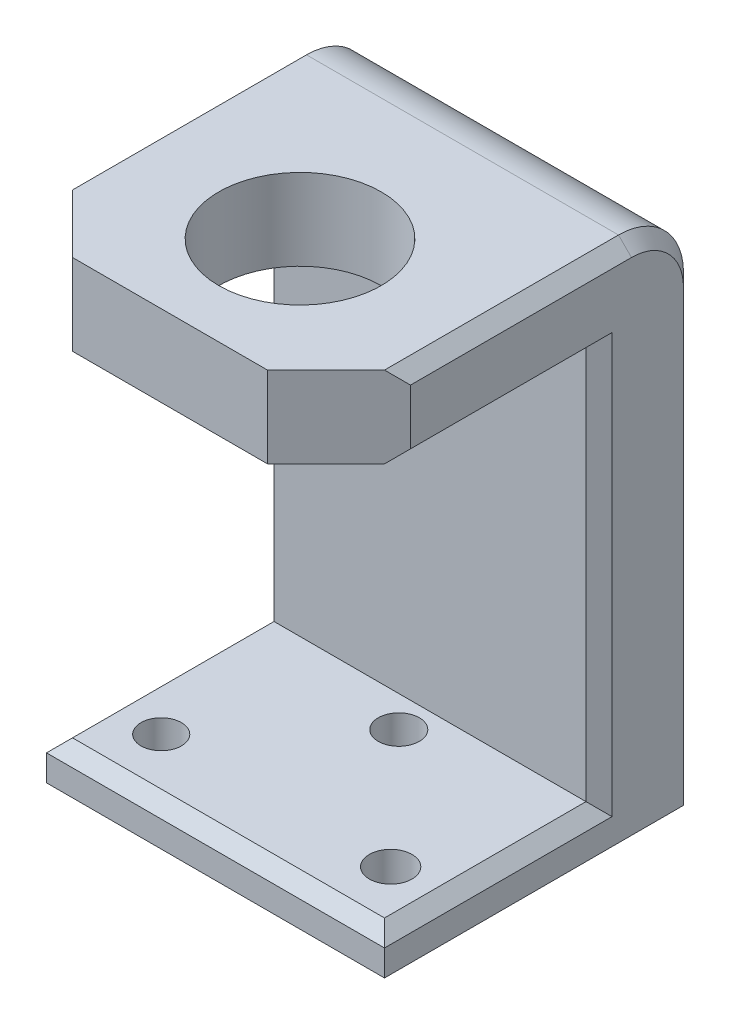
ISO-10303-21;
HEADER;
FILE_DESCRIPTION(('STEP AP214'),'2;1');
FILE_NAME('part.step','',(''),(''),'','','');
FILE_SCHEMA(('AUTOMOTIVE_DESIGN { 1 0 10303 214 1 1 1 1 }'));
ENDSEC;
DATA;
#1=APPLICATION_CONTEXT('core data for automotive mechanical design processes');
#2=APPLICATION_PROTOCOL_DEFINITION('international standard','automotive_design',2000,#1);
#3=PRODUCT_CONTEXT('',#1,'mechanical');
#4=PRODUCT('Part','Part','',(#3));
#5=PRODUCT_RELATED_PRODUCT_CATEGORY('part','',(#4));
#6=PRODUCT_DEFINITION_FORMATION('','',#4);
#7=PRODUCT_DEFINITION_CONTEXT('part definition',#1,'design');
#8=PRODUCT_DEFINITION('design','',#6,#7);
#9=PRODUCT_DEFINITION_SHAPE('','',#8);
#10=(LENGTH_UNIT() NAMED_UNIT(*) SI_UNIT(.MILLI.,.METRE.));
#11=(NAMED_UNIT(*) PLANE_ANGLE_UNIT() SI_UNIT($,.RADIAN.));
#12=(NAMED_UNIT(*) SI_UNIT($,.STERADIAN.) SOLID_ANGLE_UNIT());
#13=UNCERTAINTY_MEASURE_WITH_UNIT(LENGTH_MEASURE(1.E-05),#10,'distance_accuracy_value','');
#14=(GEOMETRIC_REPRESENTATION_CONTEXT(3) GLOBAL_UNCERTAINTY_ASSIGNED_CONTEXT((#13)) GLOBAL_UNIT_ASSIGNED_CONTEXT((#10,
#11,#12)) REPRESENTATION_CONTEXT('',''));
#15=CARTESIAN_POINT('',(0.,0.,0.));
#16=DIRECTION('',(0.,0.,1.));
#17=DIRECTION('',(1.,0.,0.));
#18=AXIS2_PLACEMENT_3D('',#15,#16,#17);
#19=CARTESIAN_POINT('',(-43.4955346226071,100.33,49.6007689250872));
#20=DIRECTION('',(0.,0.,-1.));
#21=DIRECTION('',(-1.,0.,0.));
#22=AXIS2_PLACEMENT_3D('',#19,#20,#21);
#23=PLANE('',#22);
#24=DIRECTION('',(1.,0.,0.));
#25=VECTOR('',#24,1.);
#26=CARTESIAN_POINT('',(-43.4955346226071,7.62,49.6007689250872));
#27=LINE('',#26,#25);
#28=CARTESIAN_POINT('',(-40.9555346226071,7.62,49.6007689250872));
#29=VERTEX_POINT('',#28);
#30=CARTESIAN_POINT('',(20.0044653773929,7.62,49.6007689250872));
#31=VERTEX_POINT('',#30);
#32=EDGE_CURVE('E396',#29,#31,#27,.T.);
#33=ORIENTED_EDGE('',*,*,#32,.T.);
#34=DIRECTION('',(0.,1.,0.));
#35=VECTOR('',#34,1.);
#36=CARTESIAN_POINT('',(20.0044653773929,100.33,49.6007689250872));
#37=LINE('',#36,#35);
#38=CARTESIAN_POINT('',(20.0044653773928,84.455,49.6007689250872));
#39=VERTEX_POINT('',#38);
#40=EDGE_CURVE('E293',#31,#39,#37,.T.);
#41=ORIENTED_EDGE('',*,*,#40,.T.);
#42=DIRECTION('',(1.,0.,0.));
#43=VECTOR('',#42,1.);
#44=CARTESIAN_POINT('',(-43.4955346226071,84.455,49.6007689250872));
#45=LINE('',#44,#43);
#46=CARTESIAN_POINT('',(-40.9555346226071,84.455,49.6007689250872));
#47=VERTEX_POINT('',#46);
#48=EDGE_CURVE('E421',#47,#39,#45,.T.);
#49=ORIENTED_EDGE('',*,*,#48,.F.);
#50=DIRECTION('',(0.,-1.,0.));
#51=VECTOR('',#50,1.);
#52=CARTESIAN_POINT('',(-40.9555346226071,100.33,49.6007689250872));
#53=LINE('',#52,#51);
#54=EDGE_CURVE('E290',#47,#29,#53,.T.);
#55=ORIENTED_EDGE('',*,*,#54,.T.);
#56=EDGE_LOOP('',(#33,#41,#49,#55));
#57=FACE_BOUND('',#56,.T.);
#58=ADVANCED_FACE('F39',(#57),#23,.F.);
#59=CARTESIAN_POINT('',(0.,7.62,0.));
#60=DIRECTION('',(0.,-1.,0.));
#61=DIRECTION('',(0.,0.,-1.));
#62=AXIS2_PLACEMENT_3D('',#59,#60,#61);
#63=PLANE('',#62);
#64=CARTESIAN_POINT('',(-10.4755346226071,7.62,55.6973401149321));
#65=DIRECTION('',(0.,1.,0.));
#66=DIRECTION('',(0.,0.,1.));
#67=AXIS2_PLACEMENT_3D('',#64,#65,#66);
#68=CIRCLE('',#67,4.00939943817813);
#69=CARTESIAN_POINT('',(-10.4755346226071,7.62,59.7067395531102));
#70=VERTEX_POINT('',#69);
#71=EDGE_CURVE('E431',#70,#70,#68,.T.);
#72=ORIENTED_EDGE('',*,*,#71,.F.);
#73=EDGE_LOOP('',(#72));
#74=FACE_BOUND('',#73,.T.);
#75=CARTESIAN_POINT('',(11.9399653773929,7.62,79.7003401149321));
#76=DIRECTION('',(0.,1.,0.));
#77=DIRECTION('',(0.,0.,1.));
#78=AXIS2_PLACEMENT_3D('',#75,#76,#77);
#79=CIRCLE('',#78,4.16988491083855);
#80=CARTESIAN_POINT('',(11.9399653773929,7.62,83.8702250257706));
#81=VERTEX_POINT('',#80);
#82=EDGE_CURVE('E439',#81,#81,#79,.T.);
#83=ORIENTED_EDGE('',*,*,#82,.F.);
#84=EDGE_LOOP('',(#83));
#85=FACE_BOUND('',#84,.T.);
#86=CARTESIAN_POINT('',(-32.8910346226071,7.62,79.7003401149321));
#87=DIRECTION('',(0.,1.,0.));
#88=DIRECTION('',(0.,0.,1.));
#89=AXIS2_PLACEMENT_3D('',#86,#87,#88);
#90=CIRCLE('',#89,3.94964349540739);
#91=CARTESIAN_POINT('',(-32.8910346226071,7.62,83.6499836103395));
#92=VERTEX_POINT('',#91);
#93=EDGE_CURVE('E200',#92,#92,#90,.T.);
#94=ORIENTED_EDGE('',*,*,#93,.F.);
#95=EDGE_LOOP('',(#94));
#96=FACE_BOUND('',#95,.T.);
#97=DIRECTION('',(1.,0.,0.));
#98=VECTOR('',#97,1.);
#99=CARTESIAN_POINT('',(0.,7.62,88.9707689250872));
#100=LINE('',#99,#98);
#101=CARTESIAN_POINT('',(-40.9555346226071,7.62,88.9707689250872));
#102=VERTEX_POINT('',#101);
#103=CARTESIAN_POINT('',(20.0044653773929,7.62,88.9707689250872));
#104=VERTEX_POINT('',#103);
#105=EDGE_CURVE('E299',#102,#104,#100,.T.);
#106=ORIENTED_EDGE('',*,*,#105,.T.);
#107=DIRECTION('',(0.,0.,-1.));
#108=VECTOR('',#107,1.);
#109=CARTESIAN_POINT('',(20.0044653773928,7.62,0.));
#110=LINE('',#109,#108);
#111=EDGE_CURVE('E302',#104,#31,#110,.T.);
#112=ORIENTED_EDGE('',*,*,#111,.T.);
#113=ORIENTED_EDGE('',*,*,#32,.F.);
#114=DIRECTION('',(0.,0.,1.));
#115=VECTOR('',#114,1.);
#116=CARTESIAN_POINT('',(-40.9555346226071,7.62,0.));
#117=LINE('',#116,#115);
#118=EDGE_CURVE('E296',#29,#102,#117,.T.);
#119=ORIENTED_EDGE('',*,*,#118,.T.);
#120=EDGE_LOOP('',(#106,#112,#113,#119));
#121=FACE_BOUND('',#120,.T.);
#122=ADVANCED_FACE('F423',(#74,#85,#96,#121),#63,.F.);
#123=CARTESIAN_POINT('',(0.,0.,0.));
#124=DIRECTION('',(0.,-1.,0.));
#125=DIRECTION('',(0.,0.,-1.));
#126=AXIS2_PLACEMENT_3D('',#123,#124,#125);
#127=PLANE('',#126);
#128=CARTESIAN_POINT('',(11.9399653773929,0.,79.7003401149321));
#129=DIRECTION('',(0.,1.,0.));
#130=DIRECTION('',(0.,0.,1.));
#131=AXIS2_PLACEMENT_3D('',#128,#129,#130);
#132=CIRCLE('',#131,4.16988491083855);
#133=CARTESIAN_POINT('',(11.9399653773929,0.,83.8702250257706));
#134=VERTEX_POINT('',#133);
#135=EDGE_CURVE('E437',#134,#134,#132,.T.);
#136=ORIENTED_EDGE('',*,*,#135,.T.);
#137=EDGE_LOOP('',(#136));
#138=FACE_BOUND('',#137,.T.);
#139=DIRECTION('',(0.,0.,1.));
#140=VECTOR('',#139,1.);
#141=CARTESIAN_POINT('',(-43.4955346226071,0.,30.5507689250872));
#142=LINE('',#141,#140);
#143=CARTESIAN_POINT('',(-43.4955346226071,0.,33.0907689250872));
#144=VERTEX_POINT('',#143);
#145=CARTESIAN_POINT('',(-43.4955346226071,0.,91.5107689250872));
#146=VERTEX_POINT('',#145);
#147=EDGE_CURVE('E211',#144,#146,#142,.T.);
#148=ORIENTED_EDGE('',*,*,#147,.F.);
#149=DIRECTION('',(-0.707106781186548,0.,0.707106781186548));
#150=VECTOR('',#149,1.);
#151=CARTESIAN_POINT('',(-5.20238284875994,0.,-5.20238284875994));
#152=LINE('',#151,#150);
#153=CARTESIAN_POINT('',(-40.9555346226071,0.,30.5507689250872));
#154=VERTEX_POINT('',#153);
#155=EDGE_CURVE('E257',#144,#154,#152,.F.);
#156=ORIENTED_EDGE('',*,*,#155,.T.);
#157=DIRECTION('',(-1.,0.,0.));
#158=VECTOR('',#157,1.);
#159=CARTESIAN_POINT('',(-43.4955346226071,0.,30.5507689250872));
#160=LINE('',#159,#158);
#161=CARTESIAN_POINT('',(20.0044653773929,0.,30.5507689250872));
#162=VERTEX_POINT('',#161);
#163=EDGE_CURVE('E194',#162,#154,#160,.T.);
#164=ORIENTED_EDGE('',*,*,#163,.F.);
#165=DIRECTION('',(-0.707106781186548,0.,-0.707106781186547));
#166=VECTOR('',#165,1.);
#167=CARTESIAN_POINT('',(-5.27315177384719,0.,5.2731517738472));
#168=LINE('',#167,#166);
#169=CARTESIAN_POINT('',(22.5444653773929,0.,33.0907689250872));
#170=VERTEX_POINT('',#169);
#171=EDGE_CURVE('E192',#162,#170,#168,.F.);
#172=ORIENTED_EDGE('',*,*,#171,.T.);
#173=DIRECTION('',(0.,0.,-1.));
#174=VECTOR('',#173,1.);
#175=CARTESIAN_POINT('',(22.5444653773929,0.,30.5507689250872));
#176=LINE('',#175,#174);
#177=CARTESIAN_POINT('',(22.5444653773929,0.,91.5107689250872));
#178=VERTEX_POINT('',#177);
#179=EDGE_CURVE('E173',#178,#170,#176,.T.);
#180=ORIENTED_EDGE('',*,*,#179,.F.);
#181=DIRECTION('',(1.,0.,0.));
#182=VECTOR('',#181,1.);
#183=CARTESIAN_POINT('',(-43.4955346226071,0.,91.5107689250872));
#184=LINE('',#183,#182);
#185=EDGE_CURVE('E189',#146,#178,#184,.T.);
#186=ORIENTED_EDGE('',*,*,#185,.F.);
#187=EDGE_LOOP('',(#148,#156,#164,#172,#180,#186));
#188=FACE_BOUND('',#187,.T.);
#189=CARTESIAN_POINT('',(-32.8910346226071,0.,79.7003401149321));
#190=DIRECTION('',(0.,1.,0.));
#191=DIRECTION('',(0.,0.,1.));
#192=AXIS2_PLACEMENT_3D('',#189,#190,#191);
#193=CIRCLE('',#192,3.94964349540739);
#194=CARTESIAN_POINT('',(-32.8910346226071,0.,83.6499836103395));
#195=VERTEX_POINT('',#194);
#196=EDGE_CURVE('E204',#195,#195,#193,.T.);
#197=ORIENTED_EDGE('',*,*,#196,.T.);
#198=EDGE_LOOP('',(#197));
#199=FACE_BOUND('',#198,.T.);
#200=CARTESIAN_POINT('',(-10.4755346226071,0.,55.6973401149321));
#201=DIRECTION('',(0.,1.,0.));
#202=DIRECTION('',(0.,0.,1.));
#203=AXIS2_PLACEMENT_3D('',#200,#201,#202);
#204=CIRCLE('',#203,4.00939943817813);
#205=CARTESIAN_POINT('',(-10.4755346226071,0.,59.7067395531102));
#206=VERTEX_POINT('',#205);
#207=EDGE_CURVE('E427',#206,#206,#204,.T.);
#208=ORIENTED_EDGE('',*,*,#207,.T.);
#209=EDGE_LOOP('',(#208));
#210=FACE_BOUND('',#209,.T.);
#211=ADVANCED_FACE('F187',(#138,#188,#199,#210),#127,.T.);
#212=CARTESIAN_POINT('',(-43.4955346226071,7.62,91.5107689250872));
#213=DIRECTION('',(0.,0.,-1.));
#214=DIRECTION('',(-1.,0.,0.));
#215=AXIS2_PLACEMENT_3D('',#212,#213,#214);
#216=PLANE('',#215);
#217=DIRECTION('',(0.,-1.,0.));
#218=VECTOR('',#217,1.);
#219=CARTESIAN_POINT('',(22.5444653773929,7.62,91.5107689250872));
#220=LINE('',#219,#218);
#221=CARTESIAN_POINT('',(22.5444653773929,5.08,91.5107689250872));
#222=VERTEX_POINT('',#221);
#223=EDGE_CURVE('E170',#222,#178,#220,.T.);
#224=ORIENTED_EDGE('',*,*,#223,.F.);
#225=DIRECTION('',(-1.,0.,0.));
#226=VECTOR('',#225,1.);
#227=CARTESIAN_POINT('',(-43.4955346226071,5.08,91.5107689250872));
#228=LINE('',#227,#226);
#229=CARTESIAN_POINT('',(-43.4955346226071,5.08,91.5107689250872));
#230=VERTEX_POINT('',#229);
#231=EDGE_CURVE('E305',#222,#230,#228,.T.);
#232=ORIENTED_EDGE('',*,*,#231,.T.);
#233=DIRECTION('',(0.,-1.,0.));
#234=VECTOR('',#233,1.);
#235=CARTESIAN_POINT('',(-43.4955346226071,7.62,91.5107689250872));
#236=LINE('',#235,#234);
#237=EDGE_CURVE('E182',#230,#146,#236,.T.);
#238=ORIENTED_EDGE('',*,*,#237,.T.);
#239=ORIENTED_EDGE('',*,*,#185,.T.);
#240=EDGE_LOOP('',(#224,#232,#238,#239));
#241=FACE_BOUND('',#240,.T.);
#242=ADVANCED_FACE('F196',(#241),#216,.F.);
#243=CARTESIAN_POINT('',(22.5444653773929,7.62,30.5507689250872));
#244=DIRECTION('',(-1.,0.,0.));
#245=DIRECTION('',(0.,0.,1.));
#246=AXIS2_PLACEMENT_3D('',#243,#244,#245);
#247=PLANE('',#246);
#248=DIRECTION('',(0.,0.,1.));
#249=VECTOR('',#248,1.);
#250=CARTESIAN_POINT('',(22.5444653773929,97.79,30.5507689250872));
#251=LINE('',#250,#249);
#252=CARTESIAN_POINT('',(22.5444653773929,97.79,43.2507689250872));
#253=VERTEX_POINT('',#252);
#254=CARTESIAN_POINT('',(22.5444653773929,97.79,86.4307689250872));
#255=VERTEX_POINT('',#254);
#256=EDGE_CURVE('E280',#253,#255,#251,.T.);
#257=ORIENTED_EDGE('',*,*,#256,.T.);
#258=DIRECTION('',(0.,-1.,0.));
#259=VECTOR('',#258,1.);
#260=CARTESIAN_POINT('',(22.5444653773929,86.995,86.4307689250872));
#261=LINE('',#260,#259);
#262=CARTESIAN_POINT('',(22.5444653773929,86.995,86.4307689250872));
#263=VERTEX_POINT('',#262);
#264=EDGE_CURVE('E48',#255,#263,#261,.T.);
#265=ORIENTED_EDGE('',*,*,#264,.T.);
#266=DIRECTION('',(0.,0.,-1.));
#267=VECTOR('',#266,1.);
#268=CARTESIAN_POINT('',(22.5444653773929,86.995,30.5507689250872));
#269=LINE('',#268,#267);
#270=CARTESIAN_POINT('',(22.5444653773929,86.995,47.0607689250872));
#271=VERTEX_POINT('',#270);
#272=EDGE_CURVE('E271',#263,#271,#269,.T.);
#273=ORIENTED_EDGE('',*,*,#272,.T.);
#274=DIRECTION('',(0.,-1.,0.));
#275=VECTOR('',#274,1.);
#276=CARTESIAN_POINT('',(22.5444653773929,7.62,47.0607689250872));
#277=LINE('',#276,#275);
#278=CARTESIAN_POINT('',(22.5444653773929,5.08,47.0607689250872));
#279=VERTEX_POINT('',#278);
#280=EDGE_CURVE('E268',#271,#279,#277,.T.);
#281=ORIENTED_EDGE('',*,*,#280,.T.);
#282=DIRECTION('',(0.,0.,1.));
#283=VECTOR('',#282,1.);
#284=CARTESIAN_POINT('',(22.5444653773929,5.08,30.5507689250872));
#285=LINE('',#284,#283);
#286=EDGE_CURVE('E176',#279,#222,#285,.T.);
#287=ORIENTED_EDGE('',*,*,#286,.T.);
#288=ORIENTED_EDGE('',*,*,#223,.T.);
#289=ORIENTED_EDGE('',*,*,#179,.T.);
#290=DIRECTION('',(0.,1.,0.));
#291=VECTOR('',#290,1.);
#292=CARTESIAN_POINT('',(22.5444653773929,7.62,33.0907689250872));
#293=LINE('',#292,#291);
#294=CARTESIAN_POINT('',(22.5444653773929,87.63,33.0907689250872));
#295=VERTEX_POINT('',#294);
#296=EDGE_CURVE('E274',#170,#295,#293,.T.);
#297=ORIENTED_EDGE('',*,*,#296,.T.);
#298=CARTESIAN_POINT('',(22.5444653773929,87.63,43.2507689250872));
#299=DIRECTION('',(-1.,0.,0.));
#300=DIRECTION('',(0.,0.,1.));
#301=AXIS2_PLACEMENT_3D('',#298,#299,#300);
#302=CIRCLE('',#301,10.16);
#303=EDGE_CURVE('E277',#295,#253,#302,.F.);
#304=ORIENTED_EDGE('',*,*,#303,.T.);
#305=EDGE_LOOP('',(#257,#265,#273,#281,#287,#288,#289,#297,#304));
#306=FACE_BOUND('',#305,.T.);
#307=ADVANCED_FACE('F172',(#306),#247,.F.);
#308=CARTESIAN_POINT('',(-43.4955346226071,7.62,30.5507689250872));
#309=DIRECTION('',(0.,0.,1.));
#310=DIRECTION('',(1.,0.,0.));
#311=AXIS2_PLACEMENT_3D('',#308,#309,#310);
#312=PLANE('',#311);
#313=ORIENTED_EDGE('',*,*,#163,.T.);
#314=DIRECTION('',(0.,1.,0.));
#315=VECTOR('',#314,1.);
#316=CARTESIAN_POINT('',(-40.9555346226071,7.62,30.5507689250872));
#317=LINE('',#316,#315);
#318=CARTESIAN_POINT('',(-40.9555346226071,87.63,30.5507689250872));
#319=VERTEX_POINT('',#318);
#320=EDGE_CURVE('E263',#154,#319,#317,.T.);
#321=ORIENTED_EDGE('',*,*,#320,.T.);
#322=DIRECTION('',(-1.,0.,0.));
#323=VECTOR('',#322,1.);
#324=CARTESIAN_POINT('',(-43.4955346226071,87.63,30.5507689250872));
#325=LINE('',#324,#323);
#326=CARTESIAN_POINT('',(20.0044653773929,87.63,30.5507689250872));
#327=VERTEX_POINT('',#326);
#328=EDGE_CURVE('E219',#319,#327,#325,.F.);
#329=ORIENTED_EDGE('',*,*,#328,.T.);
#330=DIRECTION('',(0.,-1.,0.));
#331=VECTOR('',#330,1.);
#332=CARTESIAN_POINT('',(20.0044653773929,7.62,30.5507689250872));
#333=LINE('',#332,#331);
#334=EDGE_CURVE('E260',#327,#162,#333,.T.);
#335=ORIENTED_EDGE('',*,*,#334,.T.);
#336=EDGE_LOOP('',(#313,#321,#329,#335));
#337=FACE_BOUND('',#336,.T.);
#338=ADVANCED_FACE('F567',(#337),#312,.F.);
#339=CARTESIAN_POINT('',(-43.4955346226071,7.62,30.5507689250872));
#340=DIRECTION('',(1.,0.,0.));
#341=DIRECTION('',(0.,0.,-1.));
#342=AXIS2_PLACEMENT_3D('',#339,#340,#341);
#343=PLANE('',#342);
#344=DIRECTION('',(0.,0.,1.));
#345=VECTOR('',#344,1.);
#346=CARTESIAN_POINT('',(-43.4955346226071,86.995,30.5507689250872));
#347=LINE('',#346,#345);
#348=CARTESIAN_POINT('',(-43.4955346226071,86.995,47.0607689250872));
#349=VERTEX_POINT('',#348);
#350=CARTESIAN_POINT('',(-43.4955346226071,86.995,86.4307689250872));
#351=VERTEX_POINT('',#350);
#352=EDGE_CURVE('E230',#349,#351,#347,.T.);
#353=ORIENTED_EDGE('',*,*,#352,.T.);
#354=DIRECTION('',(0.,1.,0.));
#355=VECTOR('',#354,1.);
#356=CARTESIAN_POINT('',(-43.4955346226071,97.79,86.4307689250872));
#357=LINE('',#356,#355);
#358=CARTESIAN_POINT('',(-43.4955346226071,97.79,86.4307689250872));
#359=VERTEX_POINT('',#358);
#360=EDGE_CURVE('E366',#351,#359,#357,.T.);
#361=ORIENTED_EDGE('',*,*,#360,.T.);
#362=DIRECTION('',(0.,0.,-1.));
#363=VECTOR('',#362,1.);
#364=CARTESIAN_POINT('',(-43.4955346226071,97.79,30.5507689250872));
#365=LINE('',#364,#363);
#366=CARTESIAN_POINT('',(-43.4955346226071,97.79,43.2507689250872));
#367=VERTEX_POINT('',#366);
#368=EDGE_CURVE('E246',#359,#367,#365,.T.);
#369=ORIENTED_EDGE('',*,*,#368,.T.);
#370=CARTESIAN_POINT('',(-43.4955346226071,87.63,43.2507689250872));
#371=DIRECTION('',(1.,0.,0.));
#372=DIRECTION('',(0.,0.,-1.));
#373=AXIS2_PLACEMENT_3D('',#370,#371,#372);
#374=CIRCLE('',#373,10.16);
#375=CARTESIAN_POINT('',(-43.4955346226071,87.63,33.0907689250872));
#376=VERTEX_POINT('',#375);
#377=EDGE_CURVE('E243',#367,#376,#374,.F.);
#378=ORIENTED_EDGE('',*,*,#377,.T.);
#379=DIRECTION('',(0.,-1.,0.));
#380=VECTOR('',#379,1.);
#381=CARTESIAN_POINT('',(-43.4955346226071,7.62,33.0907689250872));
#382=LINE('',#381,#380);
#383=EDGE_CURVE('E240',#376,#144,#382,.T.);
#384=ORIENTED_EDGE('',*,*,#383,.T.);
#385=ORIENTED_EDGE('',*,*,#147,.T.);
#386=ORIENTED_EDGE('',*,*,#237,.F.);
#387=DIRECTION('',(0.,0.,-1.));
#388=VECTOR('',#387,1.);
#389=CARTESIAN_POINT('',(-43.4955346226071,5.08,30.5507689250872));
#390=LINE('',#389,#388);
#391=CARTESIAN_POINT('',(-43.4955346226071,5.08,47.0607689250872));
#392=VERTEX_POINT('',#391);
#393=EDGE_CURVE('E237',#230,#392,#390,.T.);
#394=ORIENTED_EDGE('',*,*,#393,.T.);
#395=DIRECTION('',(0.,1.,0.));
#396=VECTOR('',#395,1.);
#397=CARTESIAN_POINT('',(-43.4955346226071,7.62,47.0607689250872));
#398=LINE('',#397,#396);
#399=EDGE_CURVE('E234',#392,#349,#398,.T.);
#400=ORIENTED_EDGE('',*,*,#399,.T.);
#401=EDGE_LOOP('',(#353,#361,#369,#378,#384,#385,#386,#394,#400));
#402=FACE_BOUND('',#401,.T.);
#403=ADVANCED_FACE('F460',(#402),#343,.F.);
#404=CARTESIAN_POINT('',(-32.8910346226071,7.62,79.7003401149321));
#405=DIRECTION('',(0.,-1.,0.));
#406=DIRECTION('',(0.,0.,-1.));
#407=AXIS2_PLACEMENT_3D('',#404,#405,#406);
#408=CYLINDRICAL_SURFACE('',#407,3.94964349540739);
#409=ORIENTED_EDGE('',*,*,#93,.T.);
#410=EDGE_LOOP('',(#409));
#411=FACE_BOUND('',#410,.T.);
#412=ORIENTED_EDGE('',*,*,#196,.F.);
#413=EDGE_LOOP('',(#412));
#414=FACE_BOUND('',#413,.T.);
#415=ADVANCED_FACE('F451',(#411,#414),#408,.F.);
#416=CARTESIAN_POINT('',(11.9399653773929,7.62,79.7003401149321));
#417=DIRECTION('',(0.,-1.,0.));
#418=DIRECTION('',(0.,0.,-1.));
#419=AXIS2_PLACEMENT_3D('',#416,#417,#418);
#420=CYLINDRICAL_SURFACE('',#419,4.16988491083855);
#421=ORIENTED_EDGE('',*,*,#82,.T.);
#422=EDGE_LOOP('',(#421));
#423=FACE_BOUND('',#422,.T.);
#424=ORIENTED_EDGE('',*,*,#135,.F.);
#425=EDGE_LOOP('',(#424));
#426=FACE_BOUND('',#425,.T.);
#427=ADVANCED_FACE('F448',(#423,#426),#420,.F.);
#428=CARTESIAN_POINT('',(-10.4755346226071,7.62,55.6973401149321));
#429=DIRECTION('',(0.,-1.,0.));
#430=DIRECTION('',(0.,0.,-1.));
#431=AXIS2_PLACEMENT_3D('',#428,#429,#430);
#432=CYLINDRICAL_SURFACE('',#431,4.00939943817813);
#433=ORIENTED_EDGE('',*,*,#71,.T.);
#434=EDGE_LOOP('',(#433));
#435=FACE_BOUND('',#434,.T.);
#436=ORIENTED_EDGE('',*,*,#207,.F.);
#437=EDGE_LOOP('',(#436));
#438=FACE_BOUND('',#437,.T.);
#439=ADVANCED_FACE('F450',(#435,#438),#432,.F.);
#440=CARTESIAN_POINT('',(0.,100.33,0.));
#441=DIRECTION('',(0.,-1.,0.));
#442=DIRECTION('',(0.,0.,-1.));
#443=AXIS2_PLACEMENT_3D('',#440,#441,#442);
#444=PLANE('',#443);
#445=CARTESIAN_POINT('',(-10.4755346226071,100.33,75.0007689250872));
#446=DIRECTION('',(0.,1.,0.));
#447=DIRECTION('',(0.,0.,1.));
#448=AXIS2_PLACEMENT_3D('',#445,#446,#447);
#449=CIRCLE('',#448,15.875);
#450=CARTESIAN_POINT('',(-10.4755346226071,100.33,90.8757689250872));
#451=VERTEX_POINT('',#450);
#452=EDGE_CURVE('E318',#451,#451,#449,.T.);
#453=ORIENTED_EDGE('',*,*,#452,.F.);
#454=EDGE_LOOP('',(#453));
#455=FACE_BOUND('',#454,.T.);
#456=DIRECTION('',(0.,0.,1.));
#457=VECTOR('',#456,1.);
#458=CARTESIAN_POINT('',(-40.9555346226071,100.33,0.));
#459=LINE('',#458,#457);
#460=CARTESIAN_POINT('',(-40.9555346226071,100.33,43.2507689250872));
#461=VERTEX_POINT('',#460);
#462=CARTESIAN_POINT('',(-40.9555346226071,100.33,88.9707689250872));
#463=VERTEX_POINT('',#462);
#464=EDGE_CURVE('E226',#461,#463,#459,.T.);
#465=ORIENTED_EDGE('',*,*,#464,.T.);
#466=DIRECTION('',(0.707106781186546,0.,0.707106781186549));
#467=VECTOR('',#466,1.);
#468=CARTESIAN_POINT('',(-29.5255346226072,100.33,100.400768925087));
#469=LINE('',#468,#467);
#470=CARTESIAN_POINT('',(-29.5255346226072,100.33,100.400768925087));
#471=VERTEX_POINT('',#470);
#472=EDGE_CURVE('E375',#463,#471,#469,.T.);
#473=ORIENTED_EDGE('',*,*,#472,.T.);
#474=DIRECTION('',(-1.,0.,0.));
#475=VECTOR('',#474,1.);
#476=CARTESIAN_POINT('',(-43.4955346226071,100.33,100.400768925087));
#477=LINE('',#476,#475);
#478=CARTESIAN_POINT('',(8.5744653773929,100.33,100.400768925087));
#479=VERTEX_POINT('',#478);
#480=EDGE_CURVE('E385',#479,#471,#477,.T.);
#481=ORIENTED_EDGE('',*,*,#480,.F.);
#482=DIRECTION('',(0.707106781186546,0.,-0.707106781186549));
#483=VECTOR('',#482,1.);
#484=CARTESIAN_POINT('',(8.5744653773929,100.33,100.400768925087));
#485=LINE('',#484,#483);
#486=CARTESIAN_POINT('',(20.0044653773929,100.33,88.9707689250872));
#487=VERTEX_POINT('',#486);
#488=EDGE_CURVE('E372',#479,#487,#485,.T.);
#489=ORIENTED_EDGE('',*,*,#488,.T.);
#490=DIRECTION('',(0.,0.,-1.));
#491=VECTOR('',#490,1.);
#492=CARTESIAN_POINT('',(20.0044653773929,100.33,0.));
#493=LINE('',#492,#491);
#494=CARTESIAN_POINT('',(20.0044653773929,100.33,43.2507689250872));
#495=VERTEX_POINT('',#494);
#496=EDGE_CURVE('E223',#487,#495,#493,.T.);
#497=ORIENTED_EDGE('',*,*,#496,.T.);
#498=DIRECTION('',(-1.,0.,0.));
#499=VECTOR('',#498,1.);
#500=CARTESIAN_POINT('',(0.,100.33,43.2507689250872));
#501=LINE('',#500,#499);
#502=EDGE_CURVE('E181',#495,#461,#501,.T.);
#503=ORIENTED_EDGE('',*,*,#502,.T.);
#504=EDGE_LOOP('',(#465,#473,#481,#489,#497,#503));
#505=FACE_BOUND('',#504,.T.);
#506=ADVANCED_FACE('F384',(#455,#505),#444,.F.);
#507=CARTESIAN_POINT('',(-43.4955346226071,84.455,100.400768925087));
#508=DIRECTION('',(0.,1.,0.));
#509=DIRECTION('',(-1.,0.,0.));
#510=AXIS2_PLACEMENT_3D('',#507,#508,#509);
#511=PLANE('',#510);
#512=CARTESIAN_POINT('',(-10.4755346226071,84.455,75.0007689250872));
#513=DIRECTION('',(0.,1.,0.));
#514=DIRECTION('',(0.,0.,1.));
#515=AXIS2_PLACEMENT_3D('',#512,#513,#514);
#516=CIRCLE('',#515,15.875);
#517=CARTESIAN_POINT('',(-10.4755346226071,84.455,90.8757689250872));
#518=VERTEX_POINT('',#517);
#519=EDGE_CURVE('E492',#518,#518,#516,.T.);
#520=ORIENTED_EDGE('',*,*,#519,.T.);
#521=EDGE_LOOP('',(#520));
#522=FACE_BOUND('',#521,.T.);
#523=DIRECTION('',(1.,0.,0.));
#524=VECTOR('',#523,1.);
#525=CARTESIAN_POINT('',(-43.4955346226071,84.455,100.400768925087));
#526=LINE('',#525,#524);
#527=CARTESIAN_POINT('',(-29.5255346226072,84.455,100.400768925087));
#528=VERTEX_POINT('',#527);
#529=CARTESIAN_POINT('',(8.5744653773929,84.455,100.400768925087));
#530=VERTEX_POINT('',#529);
#531=EDGE_CURVE('E397',#528,#530,#526,.T.);
#532=ORIENTED_EDGE('',*,*,#531,.F.);
#533=DIRECTION('',(-0.707106781186546,0.,-0.707106781186549));
#534=VECTOR('',#533,1.);
#535=CARTESIAN_POINT('',(-29.5255346226072,84.455,100.400768925087));
#536=LINE('',#535,#534);
#537=CARTESIAN_POINT('',(-40.9555346226071,84.455,88.9707689250872));
#538=VERTEX_POINT('',#537);
#539=EDGE_CURVE('E360',#528,#538,#536,.T.);
#540=ORIENTED_EDGE('',*,*,#539,.T.);
#541=DIRECTION('',(0.,0.,-1.));
#542=VECTOR('',#541,1.);
#543=CARTESIAN_POINT('',(-40.9555346226071,84.455,100.400768925087));
#544=LINE('',#543,#542);
#545=EDGE_CURVE('E283',#538,#47,#544,.T.);
#546=ORIENTED_EDGE('',*,*,#545,.T.);
#547=ORIENTED_EDGE('',*,*,#48,.T.);
#548=DIRECTION('',(0.,0.,1.));
#549=VECTOR('',#548,1.);
#550=CARTESIAN_POINT('',(20.0044653773929,84.455,100.400768925087));
#551=LINE('',#550,#549);
#552=CARTESIAN_POINT('',(20.0044653773929,84.455,88.9707689250872));
#553=VERTEX_POINT('',#552);
#554=EDGE_CURVE('E286',#39,#553,#551,.T.);
#555=ORIENTED_EDGE('',*,*,#554,.T.);
#556=DIRECTION('',(-0.707106781186546,0.,0.707106781186549));
#557=VECTOR('',#556,1.);
#558=CARTESIAN_POINT('',(8.57446537739289,84.455,100.400768925087));
#559=LINE('',#558,#557);
#560=EDGE_CURVE('E357',#553,#530,#559,.T.);
#561=ORIENTED_EDGE('',*,*,#560,.T.);
#562=EDGE_LOOP('',(#532,#540,#546,#547,#555,#561));
#563=FACE_BOUND('',#562,.T.);
#564=ADVANCED_FACE('F404',(#522,#563),#511,.F.);
#565=CARTESIAN_POINT('',(0.,0.,100.400768925087));
#566=DIRECTION('',(0.,0.,1.));
#567=DIRECTION('',(1.,0.,0.));
#568=AXIS2_PLACEMENT_3D('',#565,#566,#567);
#569=PLANE('',#568);
#570=ORIENTED_EDGE('',*,*,#480,.T.);
#571=DIRECTION('',(0.,-1.,0.));
#572=VECTOR('',#571,1.);
#573=CARTESIAN_POINT('',(-29.5255346226072,86.995,100.400768925087));
#574=LINE('',#573,#572);
#575=EDGE_CURVE('E353',#471,#528,#574,.T.);
#576=ORIENTED_EDGE('',*,*,#575,.T.);
#577=ORIENTED_EDGE('',*,*,#531,.T.);
#578=DIRECTION('',(0.,1.,0.));
#579=VECTOR('',#578,1.);
#580=CARTESIAN_POINT('',(8.5744653773929,97.79,100.400768925087));
#581=LINE('',#580,#579);
#582=EDGE_CURVE('E308',#530,#479,#581,.T.);
#583=ORIENTED_EDGE('',*,*,#582,.T.);
#584=EDGE_LOOP('',(#570,#576,#577,#583));
#585=FACE_BOUND('',#584,.T.);
#586=ADVANCED_FACE('F391',(#585),#569,.T.);
#587=CARTESIAN_POINT('',(-10.4755346226071,84.455,75.0007689250872));
#588=DIRECTION('',(0.,1.,0.));
#589=DIRECTION('',(0.,0.,1.));
#590=AXIS2_PLACEMENT_3D('',#587,#588,#589);
#591=CYLINDRICAL_SURFACE('',#590,15.875);
#592=ORIENTED_EDGE('',*,*,#519,.F.);
#593=EDGE_LOOP('',(#592));
#594=FACE_BOUND('',#593,.T.);
#595=ORIENTED_EDGE('',*,*,#452,.T.);
#596=EDGE_LOOP('',(#595));
#597=FACE_BOUND('',#596,.T.);
#598=ADVANCED_FACE('F479',(#594,#597),#591,.F.);
#599=CARTESIAN_POINT('',(0.,87.63,43.2507689250872));
#600=DIRECTION('',(-1.,0.,0.));
#601=DIRECTION('',(0.,0.,1.));
#602=AXIS2_PLACEMENT_3D('',#599,#600,#601);
#603=CYLINDRICAL_SURFACE('',#602,12.7);
#604=ORIENTED_EDGE('',*,*,#328,.F.);
#605=CARTESIAN_POINT('',(-40.9555346226071,87.63,43.2507689250872));
#606=DIRECTION('',(1.,0.,0.));
#607=DIRECTION('',(0.,0.,-1.));
#608=AXIS2_PLACEMENT_3D('',#605,#606,#607);
#609=CIRCLE('',#608,12.7);
#610=EDGE_CURVE('E252',#319,#461,#609,.T.);
#611=ORIENTED_EDGE('',*,*,#610,.T.);
#612=ORIENTED_EDGE('',*,*,#502,.F.);
#613=CARTESIAN_POINT('',(20.0044653773929,87.63,43.2507689250872));
#614=DIRECTION('',(-1.,0.,0.));
#615=DIRECTION('',(0.,0.,1.));
#616=AXIS2_PLACEMENT_3D('',#613,#614,#615);
#617=CIRCLE('',#616,12.7);
#618=EDGE_CURVE('E249',#495,#327,#617,.T.);
#619=ORIENTED_EDGE('',*,*,#618,.T.);
#620=EDGE_LOOP('',(#604,#611,#612,#619));
#621=FACE_BOUND('',#620,.T.);
#622=ADVANCED_FACE('F481',(#621),#603,.T.);
#623=CARTESIAN_POINT('',(-43.4955346226071,7.62,33.0907689250872));
#624=DIRECTION('',(0.707106781186547,0.,0.707106781186547));
#625=DIRECTION('',(0.,-1.,0.));
#626=AXIS2_PLACEMENT_3D('',#623,#624,#625);
#627=PLANE('',#626);
#628=ORIENTED_EDGE('',*,*,#155,.F.);
#629=ORIENTED_EDGE('',*,*,#383,.F.);
#630=DIRECTION('',(-0.707106781186547,0.,0.707106781186547));
#631=VECTOR('',#630,1.);
#632=CARTESIAN_POINT('',(-40.9555346226071,87.63,30.5507689250872));
#633=LINE('',#632,#631);
#634=EDGE_CURVE('E313',#319,#376,#633,.T.);
#635=ORIENTED_EDGE('',*,*,#634,.F.);
#636=ORIENTED_EDGE('',*,*,#320,.F.);
#637=EDGE_LOOP('',(#628,#629,#635,#636));
#638=FACE_BOUND('',#637,.T.);
#639=ADVANCED_FACE('F486',(#638),#627,.F.);
#640=CARTESIAN_POINT('',(-43.4955346226071,87.63,43.2507689250872));
#641=DIRECTION('',(1.,0.,0.));
#642=DIRECTION('',(0.,0.,-1.));
#643=AXIS2_PLACEMENT_3D('',#640,#641,#642);
#644=CONICAL_SURFACE('',#643,10.16,0.785398163397448);
#645=ORIENTED_EDGE('',*,*,#634,.T.);
#646=ORIENTED_EDGE('',*,*,#377,.F.);
#647=DIRECTION('',(-0.707106781186547,-0.707106781186547,0.));
#648=VECTOR('',#647,1.);
#649=CARTESIAN_POINT('',(-40.9555346226071,100.33,43.2507689250872));
#650=LINE('',#649,#648);
#651=EDGE_CURVE('E309',#461,#367,#650,.T.);
#652=ORIENTED_EDGE('',*,*,#651,.F.);
#653=ORIENTED_EDGE('',*,*,#610,.F.);
#654=EDGE_LOOP('',(#645,#646,#652,#653));
#655=FACE_BOUND('',#654,.T.);
#656=ADVANCED_FACE('F610',(#655),#644,.T.);
#657=CARTESIAN_POINT('',(-40.9555346226071,100.33,0.));
#658=DIRECTION('',(0.707106781186547,-0.707106781186547,0.));
#659=DIRECTION('',(0.,0.,1.));
#660=AXIS2_PLACEMENT_3D('',#657,#658,#659);
#661=PLANE('',#660);
#662=ORIENTED_EDGE('',*,*,#368,.F.);
#663=DIRECTION('',(-0.577350269189625,-0.577350269189625,-0.577350269189627));
#664=VECTOR('',#663,1.);
#665=CARTESIAN_POINT('',(-70.6124575976362,70.6730770249709,59.313845950058));
#666=LINE('',#665,#664);
#667=EDGE_CURVE('E369',#359,#463,#666,.F.);
#668=ORIENTED_EDGE('',*,*,#667,.T.);
#669=ORIENTED_EDGE('',*,*,#464,.F.);
#670=ORIENTED_EDGE('',*,*,#651,.T.);
#671=EDGE_LOOP('',(#662,#668,#669,#670));
#672=FACE_BOUND('',#671,.T.);
#673=ADVANCED_FACE('F605',(#672),#661,.F.);
#674=CARTESIAN_POINT('',(20.0044653773929,7.62,30.5507689250872));
#675=DIRECTION('',(-0.707106781186547,0.,0.707106781186548));
#676=DIRECTION('',(0.,-1.,0.));
#677=AXIS2_PLACEMENT_3D('',#674,#675,#676);
#678=PLANE('',#677);
#679=ORIENTED_EDGE('',*,*,#171,.F.);
#680=ORIENTED_EDGE('',*,*,#334,.F.);
#681=DIRECTION('',(-0.707106781186548,0.,-0.707106781186547));
#682=VECTOR('',#681,1.);
#683=CARTESIAN_POINT('',(22.5444653773929,87.63,33.0907689250872));
#684=LINE('',#683,#682);
#685=EDGE_CURVE('E314',#295,#327,#684,.T.);
#686=ORIENTED_EDGE('',*,*,#685,.F.);
#687=ORIENTED_EDGE('',*,*,#296,.F.);
#688=EDGE_LOOP('',(#679,#680,#686,#687));
#689=FACE_BOUND('',#688,.T.);
#690=ADVANCED_FACE('F546',(#689),#678,.F.);
#691=CARTESIAN_POINT('',(22.5444653773929,87.63,43.2507689250872));
#692=DIRECTION('',(-1.,0.,0.));
#693=DIRECTION('',(0.,0.,1.));
#694=AXIS2_PLACEMENT_3D('',#691,#692,#693);
#695=CONICAL_SURFACE('',#694,10.16,0.785398163397451);
#696=ORIENTED_EDGE('',*,*,#685,.T.);
#697=ORIENTED_EDGE('',*,*,#618,.F.);
#698=DIRECTION('',(-0.707106781186546,0.707106781186549,0.));
#699=VECTOR('',#698,1.);
#700=CARTESIAN_POINT('',(22.5444653773929,97.79,43.2507689250872));
#701=LINE('',#700,#699);
#702=EDGE_CURVE('E319',#253,#495,#701,.T.);
#703=ORIENTED_EDGE('',*,*,#702,.F.);
#704=ORIENTED_EDGE('',*,*,#303,.F.);
#705=EDGE_LOOP('',(#696,#697,#703,#704));
#706=FACE_BOUND('',#705,.T.);
#707=ADVANCED_FACE('F624',(#706),#695,.T.);
#708=CARTESIAN_POINT('',(20.0044653773929,100.33,0.));
#709=DIRECTION('',(-0.70710678118655,-0.707106781186546,0.));
#710=DIRECTION('',(0.,0.,-1.));
#711=AXIS2_PLACEMENT_3D('',#708,#709,#710);
#712=PLANE('',#711);
#713=ORIENTED_EDGE('',*,*,#496,.F.);
#714=DIRECTION('',(-0.577350269189624,0.577350269189627,0.577350269189626));
#715=VECTOR('',#714,1.);
#716=CARTESIAN_POINT('',(49.6613883524219,70.6730770249709,59.3138459500581));
#717=LINE('',#716,#715);
#718=EDGE_CURVE('E62',#487,#255,#717,.F.);
#719=ORIENTED_EDGE('',*,*,#718,.T.);
#720=ORIENTED_EDGE('',*,*,#256,.F.);
#721=ORIENTED_EDGE('',*,*,#702,.T.);
#722=EDGE_LOOP('',(#713,#719,#720,#721));
#723=FACE_BOUND('',#722,.T.);
#724=ADVANCED_FACE('F533',(#723),#712,.F.);
#725=CARTESIAN_POINT('',(-40.9555346226071,84.455,100.400768925087));
#726=DIRECTION('',(0.707106781186546,0.70710678118655,0.));
#727=DIRECTION('',(0.,0.,-1.));
#728=AXIS2_PLACEMENT_3D('',#725,#726,#727);
#729=PLANE('',#728);
#730=ORIENTED_EDGE('',*,*,#545,.F.);
#731=DIRECTION('',(0.577350269189626,-0.577350269189623,0.577350269189628));
#732=VECTOR('',#731,1.);
#733=CARTESIAN_POINT('',(-37.1455346226071,80.645,92.7807689250872));
#734=LINE('',#733,#732);
#735=EDGE_CURVE('E363',#538,#351,#734,.F.);
#736=ORIENTED_EDGE('',*,*,#735,.T.);
#737=ORIENTED_EDGE('',*,*,#352,.F.);
#738=DIRECTION('',(0.577350269189628,-0.577350269189625,0.577350269189625));
#739=VECTOR('',#738,1.);
#740=CARTESIAN_POINT('',(-46.2472012892738,89.7466666666666,44.3091022584206));
#741=LINE('',#740,#739);
#742=EDGE_CURVE('E323',#47,#349,#741,.F.);
#743=ORIENTED_EDGE('',*,*,#742,.F.);
#744=EDGE_LOOP('',(#730,#736,#737,#743));
#745=FACE_BOUND('',#744,.T.);
#746=ADVANCED_FACE('F409',(#745),#729,.F.);
#747=CARTESIAN_POINT('',(-40.9555346226071,100.33,49.6007689250872));
#748=DIRECTION('',(0.707106781186546,0.,-0.70710678118655));
#749=DIRECTION('',(0.,-1.,0.));
#750=AXIS2_PLACEMENT_3D('',#747,#748,#749);
#751=PLANE('',#750);
#752=ORIENTED_EDGE('',*,*,#742,.T.);
#753=ORIENTED_EDGE('',*,*,#399,.F.);
#754=DIRECTION('',(0.577350269189628,0.577350269189625,0.577350269189625));
#755=VECTOR('',#754,1.);
#756=CARTESIAN_POINT('',(-57.4891242643029,-8.91358964169568,33.0671792833915));
#757=LINE('',#756,#755);
#758=EDGE_CURVE('E343',#29,#392,#757,.F.);
#759=ORIENTED_EDGE('',*,*,#758,.F.);
#760=ORIENTED_EDGE('',*,*,#54,.F.);
#761=EDGE_LOOP('',(#752,#753,#759,#760));
#762=FACE_BOUND('',#761,.T.);
#763=ADVANCED_FACE('F415',(#762),#751,.F.);
#764=CARTESIAN_POINT('',(-40.9555346226071,7.62,0.));
#765=DIRECTION('',(0.707106781186546,-0.70710678118655,0.));
#766=DIRECTION('',(0.,0.,1.));
#767=AXIS2_PLACEMENT_3D('',#764,#765,#766);
#768=PLANE('',#767);
#769=ORIENTED_EDGE('',*,*,#758,.T.);
#770=ORIENTED_EDGE('',*,*,#393,.F.);
#771=DIRECTION('',(0.577350269189627,0.577350269189624,-0.577350269189627));
#772=VECTOR('',#771,1.);
#773=CARTESIAN_POINT('',(-11.2986116475779,37.276922975029,59.313845950058));
#774=LINE('',#773,#772);
#775=EDGE_CURVE('E339',#102,#230,#774,.F.);
#776=ORIENTED_EDGE('',*,*,#775,.F.);
#777=ORIENTED_EDGE('',*,*,#118,.F.);
#778=EDGE_LOOP('',(#769,#770,#776,#777));
#779=FACE_BOUND('',#778,.T.);
#780=ADVANCED_FACE('F521',(#779),#768,.F.);
#781=CARTESIAN_POINT('',(0.,7.62,88.9707689250872));
#782=DIRECTION('',(0.,-0.70710678118655,-0.707106781186546));
#783=DIRECTION('',(1.,0.,0.));
#784=AXIS2_PLACEMENT_3D('',#781,#782,#783);
#785=PLANE('',#784);
#786=ORIENTED_EDGE('',*,*,#775,.T.);
#787=ORIENTED_EDGE('',*,*,#231,.F.);
#788=DIRECTION('',(-0.577350269189627,0.577350269189624,-0.577350269189627));
#789=VECTOR('',#788,1.);
#790=CARTESIAN_POINT('',(13.3363102515952,14.2881551257976,82.3026137992896));
#791=LINE('',#790,#789);
#792=EDGE_CURVE('E335',#104,#222,#791,.F.);
#793=ORIENTED_EDGE('',*,*,#792,.F.);
#794=ORIENTED_EDGE('',*,*,#105,.F.);
#795=EDGE_LOOP('',(#786,#787,#793,#794));
#796=FACE_BOUND('',#795,.T.);
#797=ADVANCED_FACE('F517',(#796),#785,.F.);
#798=CARTESIAN_POINT('',(20.0044653773928,7.62,0.));
#799=DIRECTION('',(-0.707106781186546,-0.70710678118655,0.));
#800=DIRECTION('',(0.,0.,-1.));
#801=AXIS2_PLACEMENT_3D('',#798,#799,#800);
#802=PLANE('',#801);
#803=ORIENTED_EDGE('',*,*,#792,.T.);
#804=ORIENTED_EDGE('',*,*,#286,.F.);
#805=DIRECTION('',(-0.577350269189627,0.577350269189624,0.577350269189626));
#806=VECTOR('',#805,1.);
#807=CARTESIAN_POINT('',(21.6977987107262,5.92666666666666,47.9074355917539));
#808=LINE('',#807,#806);
#809=EDGE_CURVE('E331',#31,#279,#808,.F.);
#810=ORIENTED_EDGE('',*,*,#809,.F.);
#811=ORIENTED_EDGE('',*,*,#111,.F.);
#812=EDGE_LOOP('',(#803,#804,#810,#811));
#813=FACE_BOUND('',#812,.T.);
#814=ADVANCED_FACE('F513',(#813),#802,.F.);
#815=CARTESIAN_POINT('',(22.5444653773929,7.62,47.0607689250872));
#816=DIRECTION('',(-0.707106781186547,0.,-0.707106781186548));
#817=DIRECTION('',(0.,-1.,0.));
#818=AXIS2_PLACEMENT_3D('',#815,#816,#817);
#819=PLANE('',#818);
#820=ORIENTED_EDGE('',*,*,#809,.T.);
#821=ORIENTED_EDGE('',*,*,#280,.F.);
#822=DIRECTION('',(-0.577350269189627,-0.577350269189624,0.577350269189626));
#823=VECTOR('',#822,1.);
#824=CARTESIAN_POINT('',(28.0477987107262,92.4983333333333,41.5574355917539));
#825=LINE('',#824,#823);
#826=EDGE_CURVE('E327',#39,#271,#825,.F.);
#827=ORIENTED_EDGE('',*,*,#826,.F.);
#828=ORIENTED_EDGE('',*,*,#40,.F.);
#829=EDGE_LOOP('',(#820,#821,#827,#828));
#830=FACE_BOUND('',#829,.T.);
#831=ADVANCED_FACE('F511',(#830),#819,.F.);
#832=CARTESIAN_POINT('',(22.5444653773929,86.995,30.5507689250872));
#833=DIRECTION('',(-0.707106781186546,0.70710678118655,0.));
#834=DIRECTION('',(0.,0.,-1.));
#835=AXIS2_PLACEMENT_3D('',#832,#833,#834);
#836=PLANE('',#835);
#837=ORIENTED_EDGE('',*,*,#272,.F.);
#838=DIRECTION('',(0.577350269189626,0.577350269189623,-0.577350269189629));
#839=VECTOR('',#838,1.);
#840=CARTESIAN_POINT('',(41.1711320440596,105.621666666667,67.8041022584203));
#841=LINE('',#840,#839);
#842=EDGE_CURVE('E11',#263,#553,#841,.F.);
#843=ORIENTED_EDGE('',*,*,#842,.T.);
#844=ORIENTED_EDGE('',*,*,#554,.F.);
#845=ORIENTED_EDGE('',*,*,#826,.T.);
#846=EDGE_LOOP('',(#837,#843,#844,#845));
#847=FACE_BOUND('',#846,.T.);
#848=ADVANCED_FACE('F506',(#847),#836,.F.);
#849=CARTESIAN_POINT('',(-29.5255346226072,0.,100.400768925087));
#850=DIRECTION('',(-0.707106781186549,0.,0.707106781186546));
#851=DIRECTION('',(0.,1.,0.));
#852=AXIS2_PLACEMENT_3D('',#849,#850,#851);
#853=PLANE('',#852);
#854=ORIENTED_EDGE('',*,*,#667,.F.);
#855=ORIENTED_EDGE('',*,*,#360,.F.);
#856=ORIENTED_EDGE('',*,*,#735,.F.);
#857=ORIENTED_EDGE('',*,*,#539,.F.);
#858=ORIENTED_EDGE('',*,*,#575,.F.);
#859=ORIENTED_EDGE('',*,*,#472,.F.);
#860=EDGE_LOOP('',(#854,#855,#856,#857,#858,#859));
#861=FACE_BOUND('',#860,.T.);
#862=ADVANCED_FACE('F399',(#861),#853,.T.);
#863=CARTESIAN_POINT('',(8.5744653773929,0.,100.400768925087));
#864=DIRECTION('',(0.707106781186549,0.,0.707106781186546));
#865=DIRECTION('',(0.,-1.,0.));
#866=AXIS2_PLACEMENT_3D('',#863,#864,#865);
#867=PLANE('',#866);
#868=ORIENTED_EDGE('',*,*,#842,.F.);
#869=ORIENTED_EDGE('',*,*,#264,.F.);
#870=ORIENTED_EDGE('',*,*,#718,.F.);
#871=ORIENTED_EDGE('',*,*,#488,.F.);
#872=ORIENTED_EDGE('',*,*,#582,.F.);
#873=ORIENTED_EDGE('',*,*,#560,.F.);
#874=EDGE_LOOP('',(#868,#869,#870,#871,#872,#873));
#875=FACE_BOUND('',#874,.T.);
#876=ADVANCED_FACE('F41',(#875),#867,.T.);
#877=CLOSED_SHELL('',(#58,#122,#211,#242,#307,#338,#403,#415,#427,#439,#506,#564,#586,#598,#622,
#639,#656,#673,#690,#707,#724,#746,#763,#780,#797,#814,#831,#848,#862,#876));
#878=MANIFOLD_SOLID_BREP('B2',#877);
#879=ADVANCED_BREP_SHAPE_REPRESENTATION('',(#18,#878),#14);
#880=SHAPE_DEFINITION_REPRESENTATION(#9,#879);
ENDSEC;
END-ISO-10303-21;
